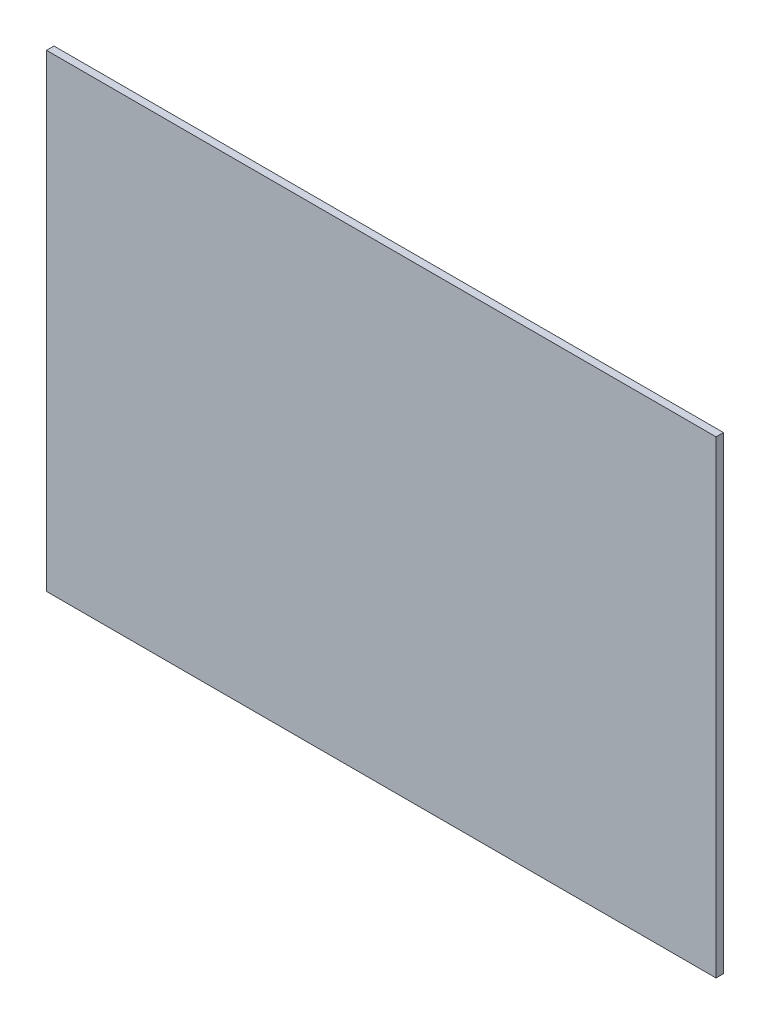
ISO-10303-21;
HEADER;
FILE_DESCRIPTION(('STEP AP214'),'2;1');
FILE_NAME('part.step','',(''),(''),'','','');
FILE_SCHEMA(('AUTOMOTIVE_DESIGN { 1 0 10303 214 1 1 1 1 }'));
ENDSEC;
DATA;
#1=APPLICATION_CONTEXT('core data for automotive mechanical design processes');
#2=APPLICATION_PROTOCOL_DEFINITION('international standard','automotive_design',2000,#1);
#3=PRODUCT_CONTEXT('',#1,'mechanical');
#4=PRODUCT('Part','Part','',(#3));
#5=PRODUCT_RELATED_PRODUCT_CATEGORY('part','',(#4));
#6=PRODUCT_DEFINITION_FORMATION('','',#4);
#7=PRODUCT_DEFINITION_CONTEXT('part definition',#1,'design');
#8=PRODUCT_DEFINITION('design','',#6,#7);
#9=PRODUCT_DEFINITION_SHAPE('','',#8);
#10=(LENGTH_UNIT() NAMED_UNIT(*) SI_UNIT(.MILLI.,.METRE.));
#11=(NAMED_UNIT(*) PLANE_ANGLE_UNIT() SI_UNIT($,.RADIAN.));
#12=(NAMED_UNIT(*) SI_UNIT($,.STERADIAN.) SOLID_ANGLE_UNIT());
#13=UNCERTAINTY_MEASURE_WITH_UNIT(LENGTH_MEASURE(1.E-05),#10,'distance_accuracy_value','');
#14=(GEOMETRIC_REPRESENTATION_CONTEXT(3) GLOBAL_UNCERTAINTY_ASSIGNED_CONTEXT((#13)) GLOBAL_UNIT_ASSIGNED_CONTEXT((#10,
#11,#12)) REPRESENTATION_CONTEXT('',''));
#15=CARTESIAN_POINT('',(0.,0.,0.));
#16=DIRECTION('',(0.,0.,1.));
#17=DIRECTION('',(1.,0.,0.));
#18=AXIS2_PLACEMENT_3D('',#15,#16,#17);
#19=CARTESIAN_POINT('',(0.,0.,2.));
#20=DIRECTION('',(1.,0.,0.));
#21=DIRECTION('',(0.,0.,-1.));
#22=AXIS2_PLACEMENT_3D('',#19,#20,#21);
#23=PLANE('',#22);
#24=DIRECTION('',(0.,-1.,0.));
#25=VECTOR('',#24,1.);
#26=CARTESIAN_POINT('',(0.,0.,0.));
#27=LINE('',#26,#25);
#28=CARTESIAN_POINT('',(0.,126.,0.));
#29=VERTEX_POINT('',#28);
#30=CARTESIAN_POINT('',(0.,0.,0.));
#31=VERTEX_POINT('',#30);
#32=EDGE_CURVE('E100',#29,#31,#27,.T.);
#33=ORIENTED_EDGE('',*,*,#32,.T.);
#34=DIRECTION('',(0.,0.,-1.));
#35=VECTOR('',#34,1.);
#36=CARTESIAN_POINT('',(0.,0.,2.));
#37=LINE('',#36,#35);
#38=CARTESIAN_POINT('',(0.,0.,2.));
#39=VERTEX_POINT('',#38);
#40=EDGE_CURVE('E11',#39,#31,#37,.T.);
#41=ORIENTED_EDGE('',*,*,#40,.F.);
#42=DIRECTION('',(0.,-1.,0.));
#43=VECTOR('',#42,1.);
#44=CARTESIAN_POINT('',(0.,0.,2.));
#45=LINE('',#44,#43);
#46=CARTESIAN_POINT('',(0.,126.,2.));
#47=VERTEX_POINT('',#46);
#48=EDGE_CURVE('E88',#47,#39,#45,.T.);
#49=ORIENTED_EDGE('',*,*,#48,.F.);
#50=DIRECTION('',(0.,0.,-1.));
#51=VECTOR('',#50,1.);
#52=CARTESIAN_POINT('',(0.,126.,2.));
#53=LINE('',#52,#51);
#54=EDGE_CURVE('E96',#47,#29,#53,.T.);
#55=ORIENTED_EDGE('',*,*,#54,.T.);
#56=EDGE_LOOP('',(#33,#41,#49,#55));
#57=FACE_BOUND('',#56,.T.);
#58=ADVANCED_FACE('F37',(#57),#23,.F.);
#59=CARTESIAN_POINT('',(0.,0.,2.));
#60=DIRECTION('',(0.,1.,0.));
#61=DIRECTION('',(0.,0.,1.));
#62=AXIS2_PLACEMENT_3D('',#59,#60,#61);
#63=PLANE('',#62);
#64=DIRECTION('',(1.,0.,0.));
#65=VECTOR('',#64,1.);
#66=CARTESIAN_POINT('',(0.,0.,0.));
#67=LINE('',#66,#65);
#68=CARTESIAN_POINT('',(180.,0.,0.));
#69=VERTEX_POINT('',#68);
#70=EDGE_CURVE('E92',#31,#69,#67,.T.);
#71=ORIENTED_EDGE('',*,*,#70,.T.);
#72=DIRECTION('',(0.,0.,-1.));
#73=VECTOR('',#72,1.);
#74=CARTESIAN_POINT('',(180.,0.,2.));
#75=LINE('',#74,#73);
#76=CARTESIAN_POINT('',(180.,0.,2.));
#77=VERTEX_POINT('',#76);
#78=EDGE_CURVE('E45',#77,#69,#75,.T.);
#79=ORIENTED_EDGE('',*,*,#78,.F.);
#80=DIRECTION('',(1.,0.,0.));
#81=VECTOR('',#80,1.);
#82=CARTESIAN_POINT('',(0.,0.,2.));
#83=LINE('',#82,#81);
#84=EDGE_CURVE('E83',#39,#77,#83,.T.);
#85=ORIENTED_EDGE('',*,*,#84,.F.);
#86=ORIENTED_EDGE('',*,*,#40,.T.);
#87=EDGE_LOOP('',(#71,#79,#85,#86));
#88=FACE_BOUND('',#87,.T.);
#89=ADVANCED_FACE('F91',(#88),#63,.F.);
#90=CARTESIAN_POINT('',(180.,0.,2.));
#91=DIRECTION('',(-1.,0.,0.));
#92=DIRECTION('',(0.,0.,1.));
#93=AXIS2_PLACEMENT_3D('',#90,#91,#92);
#94=PLANE('',#93);
#95=DIRECTION('',(0.,1.,0.));
#96=VECTOR('',#95,1.);
#97=CARTESIAN_POINT('',(180.,0.,0.));
#98=LINE('',#97,#96);
#99=CARTESIAN_POINT('',(180.,126.,0.));
#100=VERTEX_POINT('',#99);
#101=EDGE_CURVE('E70',#69,#100,#98,.T.);
#102=ORIENTED_EDGE('',*,*,#101,.T.);
#103=DIRECTION('',(0.,0.,-1.));
#104=VECTOR('',#103,1.);
#105=CARTESIAN_POINT('',(180.,126.,2.));
#106=LINE('',#105,#104);
#107=CARTESIAN_POINT('',(180.,126.,2.));
#108=VERTEX_POINT('',#107);
#109=EDGE_CURVE('E93',#108,#100,#106,.T.);
#110=ORIENTED_EDGE('',*,*,#109,.F.);
#111=DIRECTION('',(0.,1.,0.));
#112=VECTOR('',#111,1.);
#113=CARTESIAN_POINT('',(180.,0.,2.));
#114=LINE('',#113,#112);
#115=EDGE_CURVE('E86',#77,#108,#114,.T.);
#116=ORIENTED_EDGE('',*,*,#115,.F.);
#117=ORIENTED_EDGE('',*,*,#78,.T.);
#118=EDGE_LOOP('',(#102,#110,#116,#117));
#119=FACE_BOUND('',#118,.T.);
#120=ADVANCED_FACE('F94',(#119),#94,.F.);
#121=CARTESIAN_POINT('',(0.,126.,2.));
#122=DIRECTION('',(0.,-1.,0.));
#123=DIRECTION('',(0.,0.,-1.));
#124=AXIS2_PLACEMENT_3D('',#121,#122,#123);
#125=PLANE('',#124);
#126=DIRECTION('',(-1.,0.,0.));
#127=VECTOR('',#126,1.);
#128=CARTESIAN_POINT('',(0.,126.,0.));
#129=LINE('',#128,#127);
#130=EDGE_CURVE('E76',#100,#29,#129,.T.);
#131=ORIENTED_EDGE('',*,*,#130,.T.);
#132=ORIENTED_EDGE('',*,*,#54,.F.);
#133=DIRECTION('',(-1.,0.,0.));
#134=VECTOR('',#133,1.);
#135=CARTESIAN_POINT('',(0.,126.,2.));
#136=LINE('',#135,#134);
#137=EDGE_CURVE('E53',#108,#47,#136,.T.);
#138=ORIENTED_EDGE('',*,*,#137,.F.);
#139=ORIENTED_EDGE('',*,*,#109,.T.);
#140=EDGE_LOOP('',(#131,#132,#138,#139));
#141=FACE_BOUND('',#140,.T.);
#142=ADVANCED_FACE('F107',(#141),#125,.F.);
#143=CARTESIAN_POINT('',(0.,0.,2.));
#144=DIRECTION('',(0.,0.,-1.));
#145=DIRECTION('',(-1.,0.,0.));
#146=AXIS2_PLACEMENT_3D('',#143,#144,#145);
#147=PLANE('',#146);
#148=ORIENTED_EDGE('',*,*,#48,.T.);
#149=ORIENTED_EDGE('',*,*,#84,.T.);
#150=ORIENTED_EDGE('',*,*,#115,.T.);
#151=ORIENTED_EDGE('',*,*,#137,.T.);
#152=EDGE_LOOP('',(#148,#149,#150,#151));
#153=FACE_BOUND('',#152,.T.);
#154=ADVANCED_FACE('F84',(#153),#147,.F.);
#155=CARTESIAN_POINT('',(0.,0.,0.));
#156=DIRECTION('',(0.,0.,-1.));
#157=DIRECTION('',(-1.,0.,0.));
#158=AXIS2_PLACEMENT_3D('',#155,#156,#157);
#159=PLANE('',#158);
#160=ORIENTED_EDGE('',*,*,#32,.F.);
#161=ORIENTED_EDGE('',*,*,#130,.F.);
#162=ORIENTED_EDGE('',*,*,#101,.F.);
#163=ORIENTED_EDGE('',*,*,#70,.F.);
#164=EDGE_LOOP('',(#160,#161,#162,#163));
#165=FACE_BOUND('',#164,.T.);
#166=ADVANCED_FACE('F110',(#165),#159,.T.);
#167=CLOSED_SHELL('',(#58,#89,#120,#142,#154,#166));
#168=MANIFOLD_SOLID_BREP('B2',#167);
#169=ADVANCED_BREP_SHAPE_REPRESENTATION('',(#18,#168),#14);
#170=SHAPE_DEFINITION_REPRESENTATION(#9,#169);
ENDSEC;
END-ISO-10303-21;
